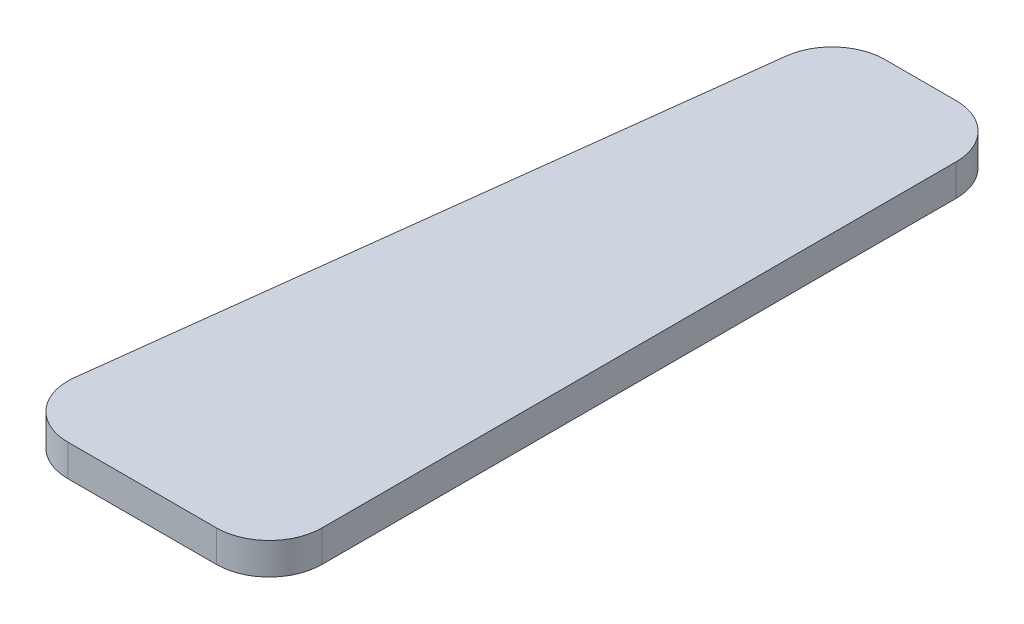
ISO-10303-21;
HEADER;
FILE_DESCRIPTION(('STEP AP214'),'2;1');
FILE_NAME('part.step','',(''),(''),'','','');
FILE_SCHEMA(('AUTOMOTIVE_DESIGN { 1 0 10303 214 1 1 1 1 }'));
ENDSEC;
DATA;
#1=APPLICATION_CONTEXT('core data for automotive mechanical design processes');
#2=APPLICATION_PROTOCOL_DEFINITION('international standard','automotive_design',2000,#1);
#3=PRODUCT_CONTEXT('',#1,'mechanical');
#4=PRODUCT('Part','Part','',(#3));
#5=PRODUCT_RELATED_PRODUCT_CATEGORY('part','',(#4));
#6=PRODUCT_DEFINITION_FORMATION('','',#4);
#7=PRODUCT_DEFINITION_CONTEXT('part definition',#1,'design');
#8=PRODUCT_DEFINITION('design','',#6,#7);
#9=PRODUCT_DEFINITION_SHAPE('','',#8);
#10=(LENGTH_UNIT() NAMED_UNIT(*) SI_UNIT(.MILLI.,.METRE.));
#11=(NAMED_UNIT(*) PLANE_ANGLE_UNIT() SI_UNIT($,.RADIAN.));
#12=(NAMED_UNIT(*) SI_UNIT($,.STERADIAN.) SOLID_ANGLE_UNIT());
#13=UNCERTAINTY_MEASURE_WITH_UNIT(LENGTH_MEASURE(1.E-05),#10,'distance_accuracy_value','');
#14=(GEOMETRIC_REPRESENTATION_CONTEXT(3) GLOBAL_UNCERTAINTY_ASSIGNED_CONTEXT((#13)) GLOBAL_UNIT_ASSIGNED_CONTEXT((#10,
#11,#12)) REPRESENTATION_CONTEXT('',''));
#15=CARTESIAN_POINT('',(0.,0.,0.));
#16=DIRECTION('',(0.,0.,1.));
#17=DIRECTION('',(1.,0.,0.));
#18=AXIS2_PLACEMENT_3D('',#15,#16,#17);
#19=CARTESIAN_POINT('',(-6.00563180116825,3.,30.8199583460327));
#20=DIRECTION('',(0.,-1.,0.));
#21=DIRECTION('',(0.,0.,-1.));
#22=AXIS2_PLACEMENT_3D('',#19,#20,#21);
#23=CYLINDRICAL_SURFACE('',#22,5.);
#24=CARTESIAN_POINT('',(-6.00563180116825,0.,30.8199583460327));
#25=DIRECTION('',(0.,1.,0.));
#26=DIRECTION('',(0.,0.,-1.));
#27=AXIS2_PLACEMENT_3D('',#24,#25,#26);
#28=CIRCLE('',#27,5.);
#29=CARTESIAN_POINT('',(-10.9688611889209,0.,30.2146864694775));
#30=VERTEX_POINT('',#29);
#31=CARTESIAN_POINT('',(-6.00563180116821,0.,35.8199583460327));
#32=VERTEX_POINT('',#31);
#33=EDGE_CURVE('E140',#30,#32,#28,.T.);
#34=ORIENTED_EDGE('',*,*,#33,.T.);
#35=DIRECTION('',(0.,-1.,0.));
#36=VECTOR('',#35,1.);
#37=CARTESIAN_POINT('',(-6.00563180116821,3.,35.8199583460327));
#38=LINE('',#37,#36);
#39=CARTESIAN_POINT('',(-6.00563180116821,3.,35.8199583460327));
#40=VERTEX_POINT('',#39);
#41=EDGE_CURVE('E11',#40,#32,#38,.T.);
#42=ORIENTED_EDGE('',*,*,#41,.F.);
#43=CARTESIAN_POINT('',(-6.00563180116825,3.,30.8199583460327));
#44=DIRECTION('',(0.,1.,0.));
#45=DIRECTION('',(0.,0.,-1.));
#46=AXIS2_PLACEMENT_3D('',#43,#44,#45);
#47=CIRCLE('',#46,5.);
#48=CARTESIAN_POINT('',(-10.9688611889209,3.,30.2146864694775));
#49=VERTEX_POINT('',#48);
#50=EDGE_CURVE('E162',#49,#40,#47,.T.);
#51=ORIENTED_EDGE('',*,*,#50,.F.);
#52=DIRECTION('',(0.,-1.,0.));
#53=VECTOR('',#52,1.);
#54=CARTESIAN_POINT('',(-10.9688611889209,3.,30.2146864694775));
#55=LINE('',#54,#53);
#56=EDGE_CURVE('E136',#49,#30,#55,.T.);
#57=ORIENTED_EDGE('',*,*,#56,.T.);
#58=EDGE_LOOP('',(#34,#42,#51,#57));
#59=FACE_BOUND('',#58,.T.);
#60=ADVANCED_FACE('F39',(#59),#23,.T.);
#61=CARTESIAN_POINT('',(-6.00563180116821,3.,35.8199583460327));
#62=DIRECTION('',(0.,0.,-1.));
#63=DIRECTION('',(-1.,0.,0.));
#64=AXIS2_PLACEMENT_3D('',#61,#62,#63);
#65=PLANE('',#64);
#66=DIRECTION('',(1.,0.,0.));
#67=VECTOR('',#66,1.);
#68=CARTESIAN_POINT('',(-6.00563180116821,0.,35.8199583460327));
#69=LINE('',#68,#67);
#70=CARTESIAN_POINT('',(8.05552766625008,0.,35.8199583460327));
#71=VERTEX_POINT('',#70);
#72=EDGE_CURVE('E144',#32,#71,#69,.T.);
#73=ORIENTED_EDGE('',*,*,#72,.T.);
#74=DIRECTION('',(0.,-1.,0.));
#75=VECTOR('',#74,1.);
#76=CARTESIAN_POINT('',(8.05552766625008,3.,35.8199583460327));
#77=LINE('',#76,#75);
#78=CARTESIAN_POINT('',(8.05552766625008,3.,35.8199583460327));
#79=VERTEX_POINT('',#78);
#80=EDGE_CURVE('E48',#79,#71,#77,.T.);
#81=ORIENTED_EDGE('',*,*,#80,.F.);
#82=DIRECTION('',(1.,0.,0.));
#83=VECTOR('',#82,1.);
#84=CARTESIAN_POINT('',(-6.00563180116821,3.,35.8199583460327));
#85=LINE('',#84,#83);
#86=EDGE_CURVE('E99',#40,#79,#85,.T.);
#87=ORIENTED_EDGE('',*,*,#86,.F.);
#88=ORIENTED_EDGE('',*,*,#41,.T.);
#89=EDGE_LOOP('',(#73,#81,#87,#88));
#90=FACE_BOUND('',#89,.T.);
#91=ADVANCED_FACE('F208',(#90),#65,.F.);
#92=CARTESIAN_POINT('',(8.0555276662501,3.,30.8199583460327));
#93=DIRECTION('',(0.,-1.,0.));
#94=DIRECTION('',(0.,0.,-1.));
#95=AXIS2_PLACEMENT_3D('',#92,#93,#94);
#96=CYLINDRICAL_SURFACE('',#95,5.);
#97=CARTESIAN_POINT('',(8.0555276662501,0.,30.8199583460327));
#98=DIRECTION('',(0.,1.,0.));
#99=DIRECTION('',(0.,0.,1.));
#100=AXIS2_PLACEMENT_3D('',#97,#98,#99);
#101=CIRCLE('',#100,5.);
#102=CARTESIAN_POINT('',(13.0555276662501,0.,30.8199583460327));
#103=VERTEX_POINT('',#102);
#104=EDGE_CURVE('E147',#71,#103,#101,.T.);
#105=ORIENTED_EDGE('',*,*,#104,.T.);
#106=DIRECTION('',(0.,-1.,0.));
#107=VECTOR('',#106,1.);
#108=CARTESIAN_POINT('',(13.0555276662501,3.,30.8199583460327));
#109=LINE('',#108,#107);
#110=CARTESIAN_POINT('',(13.0555276662501,3.,30.8199583460327));
#111=VERTEX_POINT('',#110);
#112=EDGE_CURVE('E173',#111,#103,#109,.T.);
#113=ORIENTED_EDGE('',*,*,#112,.F.);
#114=CARTESIAN_POINT('',(8.0555276662501,3.,30.8199583460327));
#115=DIRECTION('',(0.,1.,0.));
#116=DIRECTION('',(0.,0.,1.));
#117=AXIS2_PLACEMENT_3D('',#114,#115,#116);
#118=CIRCLE('',#117,5.);
#119=EDGE_CURVE('E183',#79,#111,#118,.T.);
#120=ORIENTED_EDGE('',*,*,#119,.F.);
#121=ORIENTED_EDGE('',*,*,#80,.T.);
#122=EDGE_LOOP('',(#105,#113,#120,#121));
#123=FACE_BOUND('',#122,.T.);
#124=ADVANCED_FACE('F181',(#123),#96,.T.);
#125=CARTESIAN_POINT('',(13.0555276662501,3.,30.8199583460327));
#126=DIRECTION('',(-1.,0.,0.));
#127=DIRECTION('',(0.,0.,1.));
#128=AXIS2_PLACEMENT_3D('',#125,#126,#127);
#129=PLANE('',#128);
#130=DIRECTION('',(0.,0.,-1.));
#131=VECTOR('',#130,1.);
#132=CARTESIAN_POINT('',(13.0555276662501,0.,30.8199583460327));
#133=LINE('',#132,#131);
#134=CARTESIAN_POINT('',(13.0555276662501,0.,-29.1800416539673));
#135=VERTEX_POINT('',#134);
#136=EDGE_CURVE('E150',#103,#135,#133,.T.);
#137=ORIENTED_EDGE('',*,*,#136,.T.);
#138=DIRECTION('',(0.,-1.,0.));
#139=VECTOR('',#138,1.);
#140=CARTESIAN_POINT('',(13.0555276662501,3.,-29.1800416539673));
#141=LINE('',#140,#139);
#142=CARTESIAN_POINT('',(13.0555276662501,3.,-29.1800416539673));
#143=VERTEX_POINT('',#142);
#144=EDGE_CURVE('E169',#143,#135,#141,.T.);
#145=ORIENTED_EDGE('',*,*,#144,.F.);
#146=DIRECTION('',(0.,0.,-1.));
#147=VECTOR('',#146,1.);
#148=CARTESIAN_POINT('',(13.0555276662501,3.,30.8199583460327));
#149=LINE('',#148,#147);
#150=EDGE_CURVE('E196',#111,#143,#149,.T.);
#151=ORIENTED_EDGE('',*,*,#150,.F.);
#152=ORIENTED_EDGE('',*,*,#112,.T.);
#153=EDGE_LOOP('',(#137,#145,#151,#152));
#154=FACE_BOUND('',#153,.T.);
#155=ADVANCED_FACE('F191',(#154),#129,.F.);
#156=CARTESIAN_POINT('',(8.0555276662501,3.,-29.1800416539673));
#157=DIRECTION('',(0.,-1.,0.));
#158=DIRECTION('',(0.,0.,-1.));
#159=AXIS2_PLACEMENT_3D('',#156,#157,#158);
#160=CYLINDRICAL_SURFACE('',#159,5.);
#161=CARTESIAN_POINT('',(8.0555276662501,0.,-29.1800416539673));
#162=DIRECTION('',(0.,1.,0.));
#163=DIRECTION('',(0.,0.,1.));
#164=AXIS2_PLACEMENT_3D('',#161,#162,#163);
#165=CIRCLE('',#164,5.);
#166=CARTESIAN_POINT('',(8.05552766625008,0.,-34.1800416539673));
#167=VERTEX_POINT('',#166);
#168=EDGE_CURVE('E153',#135,#167,#165,.T.);
#169=ORIENTED_EDGE('',*,*,#168,.T.);
#170=DIRECTION('',(0.,-1.,0.));
#171=VECTOR('',#170,1.);
#172=CARTESIAN_POINT('',(8.05552766625008,3.,-34.1800416539673));
#173=LINE('',#172,#171);
#174=CARTESIAN_POINT('',(8.05552766625008,3.,-34.1800416539673));
#175=VERTEX_POINT('',#174);
#176=EDGE_CURVE('E129',#175,#167,#173,.T.);
#177=ORIENTED_EDGE('',*,*,#176,.F.);
#178=CARTESIAN_POINT('',(8.0555276662501,3.,-29.1800416539673));
#179=DIRECTION('',(0.,1.,0.));
#180=DIRECTION('',(0.,0.,1.));
#181=AXIS2_PLACEMENT_3D('',#178,#179,#180);
#182=CIRCLE('',#181,5.);
#183=EDGE_CURVE('E118',#143,#175,#182,.T.);
#184=ORIENTED_EDGE('',*,*,#183,.F.);
#185=ORIENTED_EDGE('',*,*,#144,.T.);
#186=EDGE_LOOP('',(#169,#177,#184,#185));
#187=FACE_BOUND('',#186,.T.);
#188=ADVANCED_FACE('F194',(#187),#160,.T.);
#189=CARTESIAN_POINT('',(8.05552766625008,3.,-34.1800416539673));
#190=DIRECTION('',(0.,0.,1.));
#191=DIRECTION('',(1.,0.,0.));
#192=AXIS2_PLACEMENT_3D('',#189,#190,#191);
#193=PLANE('',#192);
#194=DIRECTION('',(-1.,0.,0.));
#195=VECTOR('',#194,1.);
#196=CARTESIAN_POINT('',(8.05552766625008,0.,-34.1800416539673));
#197=LINE('',#196,#195);
#198=CARTESIAN_POINT('',(1.31144136956349,0.,-34.1800416539673));
#199=VERTEX_POINT('',#198);
#200=EDGE_CURVE('E127',#167,#199,#197,.T.);
#201=ORIENTED_EDGE('',*,*,#200,.T.);
#202=DIRECTION('',(0.,-1.,0.));
#203=VECTOR('',#202,1.);
#204=CARTESIAN_POINT('',(1.31144136956349,3.,-34.1800416539673));
#205=LINE('',#204,#203);
#206=CARTESIAN_POINT('',(1.31144136956349,3.,-34.1800416539673));
#207=VERTEX_POINT('',#206);
#208=EDGE_CURVE('E124',#207,#199,#205,.T.);
#209=ORIENTED_EDGE('',*,*,#208,.F.);
#210=DIRECTION('',(-1.,0.,0.));
#211=VECTOR('',#210,1.);
#212=CARTESIAN_POINT('',(8.05552766625008,3.,-34.1800416539673));
#213=LINE('',#212,#211);
#214=EDGE_CURVE('E112',#175,#207,#213,.T.);
#215=ORIENTED_EDGE('',*,*,#214,.F.);
#216=ORIENTED_EDGE('',*,*,#176,.T.);
#217=EDGE_LOOP('',(#201,#209,#215,#216));
#218=FACE_BOUND('',#217,.T.);
#219=ADVANCED_FACE('F125',(#218),#193,.F.);
#220=CARTESIAN_POINT('',(1.31144136956346,3.,-29.1800416539673));
#221=DIRECTION('',(0.,-1.,0.));
#222=DIRECTION('',(0.,0.,-1.));
#223=AXIS2_PLACEMENT_3D('',#220,#221,#222);
#224=CYLINDRICAL_SURFACE('',#223,5.);
#225=CARTESIAN_POINT('',(1.31144136956346,0.,-29.1800416539673));
#226=DIRECTION('',(0.,1.,0.));
#227=DIRECTION('',(0.,0.,1.));
#228=AXIS2_PLACEMENT_3D('',#225,#226,#227);
#229=CIRCLE('',#228,5.);
#230=CARTESIAN_POINT('',(-3.65178801818918,0.,-29.7853135305225));
#231=VERTEX_POINT('',#230);
#232=EDGE_CURVE('E85',#199,#231,#229,.T.);
#233=ORIENTED_EDGE('',*,*,#232,.T.);
#234=DIRECTION('',(0.,-1.,0.));
#235=VECTOR('',#234,1.);
#236=CARTESIAN_POINT('',(-3.65178801818918,3.,-29.7853135305225));
#237=LINE('',#236,#235);
#238=CARTESIAN_POINT('',(-3.65178801818918,3.,-29.7853135305225));
#239=VERTEX_POINT('',#238);
#240=EDGE_CURVE('E130',#239,#231,#237,.T.);
#241=ORIENTED_EDGE('',*,*,#240,.F.);
#242=CARTESIAN_POINT('',(1.31144136956346,3.,-29.1800416539673));
#243=DIRECTION('',(0.,1.,0.));
#244=DIRECTION('',(0.,0.,1.));
#245=AXIS2_PLACEMENT_3D('',#242,#243,#244);
#246=CIRCLE('',#245,5.);
#247=EDGE_CURVE('E116',#207,#239,#246,.T.);
#248=ORIENTED_EDGE('',*,*,#247,.F.);
#249=ORIENTED_EDGE('',*,*,#208,.T.);
#250=EDGE_LOOP('',(#233,#241,#248,#249));
#251=FACE_BOUND('',#250,.T.);
#252=ADVANCED_FACE('F132',(#251),#224,.T.);
#253=CARTESIAN_POINT('',(-3.65178801818918,3.,-29.7853135305225));
#254=DIRECTION('',(0.992645877550526,0.,0.12105437531104));
#255=DIRECTION('',(0.12105437531104,0.,-0.992645877550526));
#256=AXIS2_PLACEMENT_3D('',#253,#254,#255);
#257=PLANE('',#256);
#258=DIRECTION('',(-0.12105437531104,0.,0.992645877550526));
#259=VECTOR('',#258,1.);
#260=CARTESIAN_POINT('',(-3.65178801818918,0.,-29.7853135305225));
#261=LINE('',#260,#259);
#262=EDGE_CURVE('E91',#231,#30,#261,.T.);
#263=ORIENTED_EDGE('',*,*,#262,.T.);
#264=ORIENTED_EDGE('',*,*,#56,.F.);
#265=DIRECTION('',(-0.12105437531104,0.,0.992645877550526));
#266=VECTOR('',#265,1.);
#267=CARTESIAN_POINT('',(-3.65178801818918,3.,-29.7853135305225));
#268=LINE('',#267,#266);
#269=EDGE_CURVE('E56',#239,#49,#268,.T.);
#270=ORIENTED_EDGE('',*,*,#269,.F.);
#271=ORIENTED_EDGE('',*,*,#240,.T.);
#272=EDGE_LOOP('',(#263,#264,#270,#271));
#273=FACE_BOUND('',#272,.T.);
#274=ADVANCED_FACE('F224',(#273),#257,.F.);
#275=CARTESIAN_POINT('',(-6.00563180116825,3.,30.8199583460327));
#276=DIRECTION('',(0.,-1.,0.));
#277=DIRECTION('',(0.,0.,-1.));
#278=AXIS2_PLACEMENT_3D('',#275,#276,#277);
#279=PLANE('',#278);
#280=ORIENTED_EDGE('',*,*,#50,.T.);
#281=ORIENTED_EDGE('',*,*,#86,.T.);
#282=ORIENTED_EDGE('',*,*,#119,.T.);
#283=ORIENTED_EDGE('',*,*,#150,.T.);
#284=ORIENTED_EDGE('',*,*,#183,.T.);
#285=ORIENTED_EDGE('',*,*,#214,.T.);
#286=ORIENTED_EDGE('',*,*,#247,.T.);
#287=ORIENTED_EDGE('',*,*,#269,.T.);
#288=EDGE_LOOP('',(#280,#281,#282,#283,#284,#285,#286,#287));
#289=FACE_BOUND('',#288,.T.);
#290=ADVANCED_FACE('F114',(#289),#279,.F.);
#291=CARTESIAN_POINT('',(-6.00563180116825,0.,30.8199583460327));
#292=DIRECTION('',(0.,-1.,0.));
#293=DIRECTION('',(0.,0.,-1.));
#294=AXIS2_PLACEMENT_3D('',#291,#292,#293);
#295=PLANE('',#294);
#296=ORIENTED_EDGE('',*,*,#33,.F.);
#297=ORIENTED_EDGE('',*,*,#262,.F.);
#298=ORIENTED_EDGE('',*,*,#232,.F.);
#299=ORIENTED_EDGE('',*,*,#200,.F.);
#300=ORIENTED_EDGE('',*,*,#168,.F.);
#301=ORIENTED_EDGE('',*,*,#136,.F.);
#302=ORIENTED_EDGE('',*,*,#104,.F.);
#303=ORIENTED_EDGE('',*,*,#72,.F.);
#304=EDGE_LOOP('',(#296,#297,#298,#299,#300,#301,#302,#303));
#305=FACE_BOUND('',#304,.T.);
#306=ADVANCED_FACE('F187',(#305),#295,.T.);
#307=CLOSED_SHELL('',(#60,#91,#124,#155,#188,#219,#252,#274,#290,#306));
#308=MANIFOLD_SOLID_BREP('B2',#307);
#309=ADVANCED_BREP_SHAPE_REPRESENTATION('',(#18,#308),#14);
#310=SHAPE_DEFINITION_REPRESENTATION(#9,#309);
ENDSEC;
END-ISO-10303-21;
